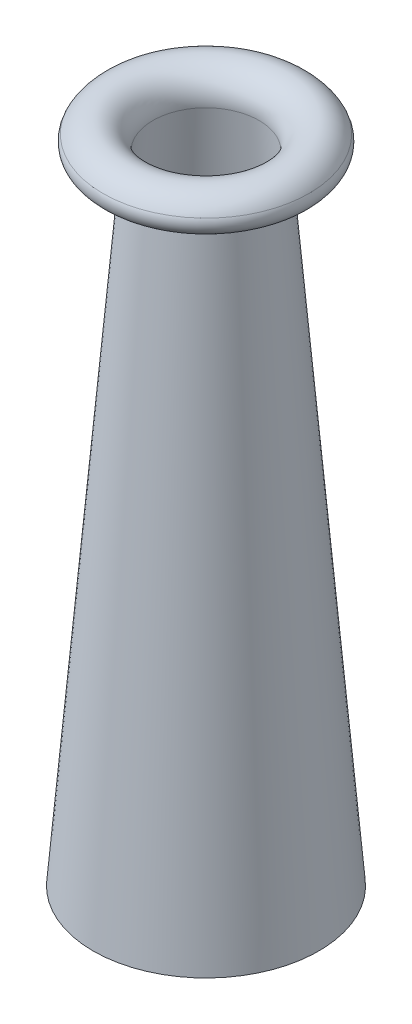
ISO-10303-21;
HEADER;
FILE_DESCRIPTION(('STEP AP214'),'2;1');
FILE_NAME('part.step','',(''),(''),'','','');
FILE_SCHEMA(('AUTOMOTIVE_DESIGN { 1 0 10303 214 1 1 1 1 }'));
ENDSEC;
DATA;
#1=APPLICATION_CONTEXT('core data for automotive mechanical design processes');
#2=APPLICATION_PROTOCOL_DEFINITION('international standard','automotive_design',2000,#1);
#3=PRODUCT_CONTEXT('',#1,'mechanical');
#4=PRODUCT('Part','Part','',(#3));
#5=PRODUCT_RELATED_PRODUCT_CATEGORY('part','',(#4));
#6=PRODUCT_DEFINITION_FORMATION('','',#4);
#7=PRODUCT_DEFINITION_CONTEXT('part definition',#1,'design');
#8=PRODUCT_DEFINITION('design','',#6,#7);
#9=PRODUCT_DEFINITION_SHAPE('','',#8);
#10=(LENGTH_UNIT() NAMED_UNIT(*) SI_UNIT(.MILLI.,.METRE.));
#11=(NAMED_UNIT(*) PLANE_ANGLE_UNIT() SI_UNIT($,.RADIAN.));
#12=(NAMED_UNIT(*) SI_UNIT($,.STERADIAN.) SOLID_ANGLE_UNIT());
#13=UNCERTAINTY_MEASURE_WITH_UNIT(LENGTH_MEASURE(1.E-05),#10,'distance_accuracy_value','');
#14=(GEOMETRIC_REPRESENTATION_CONTEXT(3) GLOBAL_UNCERTAINTY_ASSIGNED_CONTEXT((#13)) GLOBAL_UNIT_ASSIGNED_CONTEXT((#10,
#11,#12)) REPRESENTATION_CONTEXT('',''));
#15=CARTESIAN_POINT('',(0.,0.,0.));
#16=DIRECTION('',(0.,0.,1.));
#17=DIRECTION('',(1.,0.,0.));
#18=AXIS2_PLACEMENT_3D('',#15,#16,#17);
#19=CARTESIAN_POINT('',(0.,49.9347448429688,0.));
#20=DIRECTION('',(0.,1.,0.));
#21=DIRECTION('',(0.,0.,1.));
#22=AXIS2_PLACEMENT_3D('',#19,#20,#21);
#23=TOROIDAL_SURFACE('',#22,19.04061206333,6.36258998733499);
#24=CARTESIAN_POINT('',(0.,52.9386207558016,0.));
#25=DIRECTION('',(0.,1.,0.));
#26=DIRECTION('',(0.,0.,1.));
#27=AXIS2_PLACEMENT_3D('',#24,#25,#26);
#28=CIRCLE('',#27,24.6494694199792);
#29=CARTESIAN_POINT('',(0.,52.9386207558016,24.6494694199792));
#30=VERTEX_POINT('',#29);
#31=EDGE_CURVE('E10',#30,#30,#28,.T.);
#32=ORIENTED_EDGE('',*,*,#31,.T.);
#33=EDGE_LOOP('',(#32));
#34=FACE_BOUND('',#33,.T.);
#35=CARTESIAN_POINT('',(0.,49.4063605043579,0.));
#36=DIRECTION('',(0.,1.,0.));
#37=DIRECTION('',(0.,0.,1.));
#38=AXIS2_PLACEMENT_3D('',#35,#36,#37);
#39=CIRCLE('',#38,12.7);
#40=CARTESIAN_POINT('',(0.,49.4063605043579,12.7));
#41=VERTEX_POINT('',#40);
#42=EDGE_CURVE('E67',#41,#41,#39,.T.);
#43=ORIENTED_EDGE('',*,*,#42,.F.);
#44=EDGE_LOOP('',(#43));
#45=FACE_BOUND('',#44,.T.);
#46=ADVANCED_FACE('F39',(#34,#45),#23,.T.);
#47=CARTESIAN_POINT('',(0.,51.489193269645,0.));
#48=DIRECTION('',(0.,1.,0.));
#49=DIRECTION('',(0.,0.,1.));
#50=AXIS2_PLACEMENT_3D('',#47,#48,#49);
#51=TOROIDAL_SURFACE('',#50,21.9430886457506,3.07007116085945);
#52=CARTESIAN_POINT('',(0.,50.4714246277323,0.));
#53=DIRECTION('',(0.,1.,0.));
#54=DIRECTION('',(0.,0.,1.));
#55=AXIS2_PLACEMENT_3D('',#52,#53,#54);
#56=CIRCLE('',#55,19.0466280600909);
#57=CARTESIAN_POINT('',(0.,50.4714246277323,19.0466280600909));
#58=VERTEX_POINT('',#57);
#59=EDGE_CURVE('E45',#58,#58,#56,.T.);
#60=ORIENTED_EDGE('',*,*,#59,.T.);
#61=EDGE_LOOP('',(#60));
#62=FACE_BOUND('',#61,.T.);
#63=ORIENTED_EDGE('',*,*,#31,.F.);
#64=EDGE_LOOP('',(#63));
#65=FACE_BOUND('',#64,.T.);
#66=ADVANCED_FACE('F75',(#62,#65),#51,.T.);
#67=CARTESIAN_POINT('',(0.,50.4714246277323,0.));
#68=DIRECTION('',(0.,1.,0.));
#69=DIRECTION('',(0.,0.,1.));
#70=AXIS2_PLACEMENT_3D('',#67,#68,#69);
#71=CONICAL_SURFACE('',#70,19.0466280600909,1.23288946632691);
#72=CARTESIAN_POINT('',(0.,51.0019118039099,0.));
#73=DIRECTION('',(0.,1.,0.));
#74=DIRECTION('',(0.,0.,1.));
#75=AXIS2_PLACEMENT_3D('',#72,#73,#74);
#76=CIRCLE('',#75,20.5563377659321);
#77=CARTESIAN_POINT('',(0.,51.0019118039099,20.5563377659321));
#78=VERTEX_POINT('',#77);
#79=EDGE_CURVE('E49',#78,#78,#76,.T.);
#80=ORIENTED_EDGE('',*,*,#79,.T.);
#81=EDGE_LOOP('',(#80));
#82=FACE_BOUND('',#81,.T.);
#83=ORIENTED_EDGE('',*,*,#59,.F.);
#84=EDGE_LOOP('',(#83));
#85=FACE_BOUND('',#84,.T.);
#86=ADVANCED_FACE('F79',(#82,#85),#71,.F.);
#87=CARTESIAN_POINT('',(0.,51.489193269645,0.));
#88=DIRECTION('',(0.,1.,0.));
#89=DIRECTION('',(0.,0.,1.));
#90=AXIS2_PLACEMENT_3D('',#87,#88,#89);
#91=TOROIDAL_SURFACE('',#90,21.9430886457506,1.46987116085946);
#92=CARTESIAN_POINT('',(0.,52.1831418949473,0.));
#93=DIRECTION('',(0.,1.,0.));
#94=DIRECTION('',(0.,0.,1.));
#95=AXIS2_PLACEMENT_3D('',#92,#93,#94);
#96=CIRCLE('',#95,23.2388341975343);
#97=CARTESIAN_POINT('',(0.,52.1831418949473,23.2388341975343));
#98=VERTEX_POINT('',#97);
#99=EDGE_CURVE('E53',#98,#98,#96,.T.);
#100=ORIENTED_EDGE('',*,*,#99,.T.);
#101=EDGE_LOOP('',(#100));
#102=FACE_BOUND('',#101,.T.);
#103=ORIENTED_EDGE('',*,*,#79,.F.);
#104=EDGE_LOOP('',(#103));
#105=FACE_BOUND('',#104,.T.);
#106=ADVANCED_FACE('F83',(#102,#105),#91,.F.);
#107=CARTESIAN_POINT('',(0.,49.9347448429688,0.));
#108=DIRECTION('',(0.,1.,0.));
#109=DIRECTION('',(0.,0.,1.));
#110=AXIS2_PLACEMENT_3D('',#107,#108,#109);
#111=TOROIDAL_SURFACE('',#110,19.04061206333,4.76238998733499);
#112=CARTESIAN_POINT('',(0.,49.5392498812199,0.));
#113=DIRECTION('',(0.,1.,0.));
#114=DIRECTION('',(0.,0.,1.));
#115=AXIS2_PLACEMENT_3D('',#112,#113,#114);
#116=CIRCLE('',#115,14.2946725223435);
#117=CARTESIAN_POINT('',(0.,49.5392498812199,14.2946725223435));
#118=VERTEX_POINT('',#117);
#119=EDGE_CURVE('E58',#118,#118,#116,.T.);
#120=ORIENTED_EDGE('',*,*,#119,.T.);
#121=EDGE_LOOP('',(#120));
#122=FACE_BOUND('',#121,.T.);
#123=ORIENTED_EDGE('',*,*,#99,.F.);
#124=EDGE_LOOP('',(#123));
#125=FACE_BOUND('',#124,.T.);
#126=ADVANCED_FACE('F90',(#122,#125),#111,.F.);
#127=CARTESIAN_POINT('',(0.,49.5392498812199,0.));
#128=DIRECTION('',(0.,-1.,0.));
#129=DIRECTION('',(0.,0.,-1.));
#130=AXIS2_PLACEMENT_3D('',#127,#128,#129);
#131=CONICAL_SURFACE('',#130,14.2946725223435,0.0831412318884411);
#132=CARTESIAN_POINT('',(0.,-102.86075011878,0.));
#133=DIRECTION('',(0.,1.,0.));
#134=DIRECTION('',(0.,0.,1.));
#135=AXIS2_PLACEMENT_3D('',#132,#133,#134);
#136=CIRCLE('',#135,26.9946725223434);
#137=CARTESIAN_POINT('',(0.,-102.86075011878,26.9946725223434));
#138=VERTEX_POINT('',#137);
#139=EDGE_CURVE('E61',#138,#138,#136,.T.);
#140=ORIENTED_EDGE('',*,*,#139,.T.);
#141=EDGE_LOOP('',(#140));
#142=FACE_BOUND('',#141,.T.);
#143=ORIENTED_EDGE('',*,*,#119,.F.);
#144=EDGE_LOOP('',(#143));
#145=FACE_BOUND('',#144,.T.);
#146=ADVANCED_FACE('F94',(#142,#145),#131,.T.);
#147=CARTESIAN_POINT('',(0.,-102.86075011878,0.));
#148=DIRECTION('',(0.,1.,0.));
#149=DIRECTION('',(0.,0.,1.));
#150=AXIS2_PLACEMENT_3D('',#147,#148,#149);
#151=CONICAL_SURFACE('',#150,26.9946725223434,1.48765509490649);
#152=CARTESIAN_POINT('',(0.,-102.993639495642,0.));
#153=DIRECTION('',(0.,1.,0.));
#154=DIRECTION('',(0.,0.,1.));
#155=AXIS2_PLACEMENT_3D('',#152,#153,#154);
#156=CIRCLE('',#155,25.4);
#157=CARTESIAN_POINT('',(0.,-102.993639495642,25.4));
#158=VERTEX_POINT('',#157);
#159=EDGE_CURVE('E64',#158,#158,#156,.T.);
#160=ORIENTED_EDGE('',*,*,#159,.T.);
#161=EDGE_LOOP('',(#160));
#162=FACE_BOUND('',#161,.T.);
#163=ORIENTED_EDGE('',*,*,#139,.F.);
#164=EDGE_LOOP('',(#163));
#165=FACE_BOUND('',#164,.T.);
#166=ADVANCED_FACE('F98',(#162,#165),#151,.T.);
#167=CARTESIAN_POINT('',(0.,-102.993639495642,0.));
#168=DIRECTION('',(0.,-1.,0.));
#169=DIRECTION('',(0.,0.,-1.));
#170=AXIS2_PLACEMENT_3D('',#167,#168,#169);
#171=CONICAL_SURFACE('',#170,25.4,0.0831412318884411);
#172=ORIENTED_EDGE('',*,*,#42,.T.);
#173=EDGE_LOOP('',(#172));
#174=FACE_BOUND('',#173,.T.);
#175=ORIENTED_EDGE('',*,*,#159,.F.);
#176=EDGE_LOOP('',(#175));
#177=FACE_BOUND('',#176,.T.);
#178=ADVANCED_FACE('F71',(#174,#177),#171,.F.);
#179=CLOSED_SHELL('',(#46,#66,#86,#106,#126,#146,#166,#178));
#180=MANIFOLD_SOLID_BREP('B2',#179);
#181=ADVANCED_BREP_SHAPE_REPRESENTATION('',(#18,#180),#14);
#182=SHAPE_DEFINITION_REPRESENTATION(#9,#181);
ENDSEC;
END-ISO-10303-21;
